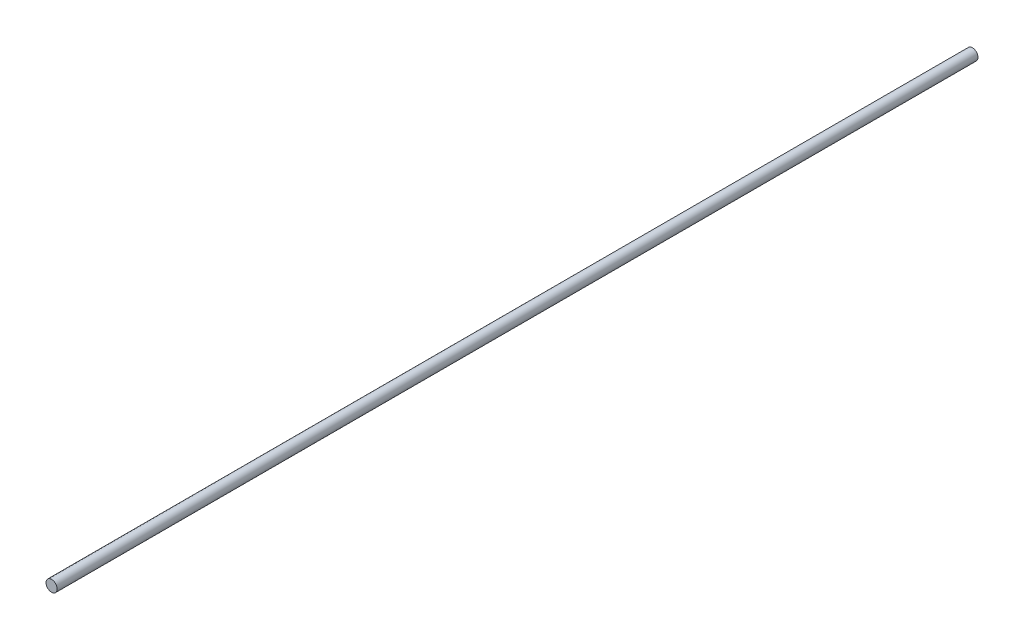
ISO-10303-21;
HEADER;
FILE_DESCRIPTION(('STEP AP214'),'2;1');
FILE_NAME('part.step','',(''),(''),'','','');
FILE_SCHEMA(('AUTOMOTIVE_DESIGN { 1 0 10303 214 1 1 1 1 }'));
ENDSEC;
DATA;
#1=APPLICATION_CONTEXT('core data for automotive mechanical design processes');
#2=APPLICATION_PROTOCOL_DEFINITION('international standard','automotive_design',2000,#1);
#3=PRODUCT_CONTEXT('',#1,'mechanical');
#4=PRODUCT('Part','Part','',(#3));
#5=PRODUCT_RELATED_PRODUCT_CATEGORY('part','',(#4));
#6=PRODUCT_DEFINITION_FORMATION('','',#4);
#7=PRODUCT_DEFINITION_CONTEXT('part definition',#1,'design');
#8=PRODUCT_DEFINITION('design','',#6,#7);
#9=PRODUCT_DEFINITION_SHAPE('','',#8);
#10=(LENGTH_UNIT() NAMED_UNIT(*) SI_UNIT(.MILLI.,.METRE.));
#11=(NAMED_UNIT(*) PLANE_ANGLE_UNIT() SI_UNIT($,.RADIAN.));
#12=(NAMED_UNIT(*) SI_UNIT($,.STERADIAN.) SOLID_ANGLE_UNIT());
#13=UNCERTAINTY_MEASURE_WITH_UNIT(LENGTH_MEASURE(1.E-05),#10,'distance_accuracy_value','');
#14=(GEOMETRIC_REPRESENTATION_CONTEXT(3) GLOBAL_UNCERTAINTY_ASSIGNED_CONTEXT((#13)) GLOBAL_UNIT_ASSIGNED_CONTEXT((#10,
#11,#12)) REPRESENTATION_CONTEXT('',''));
#15=CARTESIAN_POINT('',(0.,0.,0.));
#16=DIRECTION('',(0.,0.,1.));
#17=DIRECTION('',(1.,0.,0.));
#18=AXIS2_PLACEMENT_3D('',#15,#16,#17);
#19=CARTESIAN_POINT('',(0.,0.,660.));
#20=DIRECTION('',(0.,0.,-1.));
#21=DIRECTION('',(-1.,0.,0.));
#22=AXIS2_PLACEMENT_3D('',#19,#20,#21);
#23=CYLINDRICAL_SURFACE('',#22,4.);
#24=CARTESIAN_POINT('',(0.,0.,660.));
#25=DIRECTION('',(0.,0.,1.));
#26=DIRECTION('',(1.,0.,0.));
#27=AXIS2_PLACEMENT_3D('',#24,#25,#26);
#28=CIRCLE('',#27,4.);
#29=CARTESIAN_POINT('',(4.,0.,660.));
#30=VERTEX_POINT('',#29);
#31=EDGE_CURVE('E10',#30,#30,#28,.T.);
#32=ORIENTED_EDGE('',*,*,#31,.F.);
#33=EDGE_LOOP('',(#32));
#34=FACE_BOUND('',#33,.T.);
#35=CARTESIAN_POINT('',(0.,0.,0.));
#36=DIRECTION('',(0.,0.,1.));
#37=DIRECTION('',(1.,0.,0.));
#38=AXIS2_PLACEMENT_3D('',#35,#36,#37);
#39=CIRCLE('',#38,4.);
#40=CARTESIAN_POINT('',(4.,0.,0.));
#41=VERTEX_POINT('',#40);
#42=EDGE_CURVE('E40',#41,#41,#39,.T.);
#43=ORIENTED_EDGE('',*,*,#42,.T.);
#44=EDGE_LOOP('',(#43));
#45=FACE_BOUND('',#44,.T.);
#46=ADVANCED_FACE('F37',(#34,#45),#23,.T.);
#47=CARTESIAN_POINT('',(0.,0.,660.));
#48=DIRECTION('',(0.,0.,1.));
#49=DIRECTION('',(1.,0.,0.));
#50=AXIS2_PLACEMENT_3D('',#47,#48,#49);
#51=PLANE('',#50);
#52=ORIENTED_EDGE('',*,*,#31,.T.);
#53=EDGE_LOOP('',(#52));
#54=FACE_BOUND('',#53,.T.);
#55=ADVANCED_FACE('F54',(#54),#51,.T.);
#56=CARTESIAN_POINT('',(0.,0.,0.));
#57=DIRECTION('',(0.,0.,1.));
#58=DIRECTION('',(1.,0.,0.));
#59=AXIS2_PLACEMENT_3D('',#56,#57,#58);
#60=PLANE('',#59);
#61=ORIENTED_EDGE('',*,*,#42,.F.);
#62=EDGE_LOOP('',(#61));
#63=FACE_BOUND('',#62,.T.);
#64=ADVANCED_FACE('F52',(#63),#60,.F.);
#65=CLOSED_SHELL('',(#46,#55,#64));
#66=MANIFOLD_SOLID_BREP('B2',#65);
#67=ADVANCED_BREP_SHAPE_REPRESENTATION('',(#18,#66),#14);
#68=SHAPE_DEFINITION_REPRESENTATION(#9,#67);
ENDSEC;
END-ISO-10303-21;
